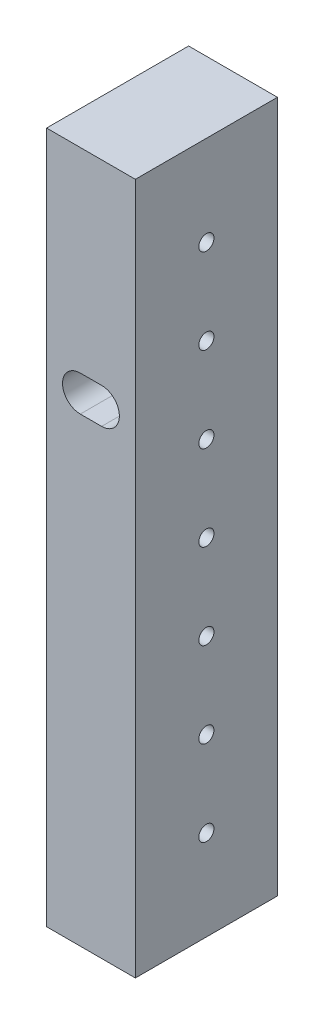
ISO-10303-21;
HEADER;
FILE_DESCRIPTION(('STEP AP214'),'2;1');
FILE_NAME('part.step','',(''),(''),'','','');
FILE_SCHEMA(('AUTOMOTIVE_DESIGN { 1 0 10303 214 1 1 1 1 }'));
ENDSEC;
DATA;
#1=APPLICATION_CONTEXT('core data for automotive mechanical design processes');
#2=APPLICATION_PROTOCOL_DEFINITION('international standard','automotive_design',2000,#1);
#3=PRODUCT_CONTEXT('',#1,'mechanical');
#4=PRODUCT('Part','Part','',(#3));
#5=PRODUCT_RELATED_PRODUCT_CATEGORY('part','',(#4));
#6=PRODUCT_DEFINITION_FORMATION('','',#4);
#7=PRODUCT_DEFINITION_CONTEXT('part definition',#1,'design');
#8=PRODUCT_DEFINITION('design','',#6,#7);
#9=PRODUCT_DEFINITION_SHAPE('','',#8);
#10=(LENGTH_UNIT() NAMED_UNIT(*) SI_UNIT(.MILLI.,.METRE.));
#11=(NAMED_UNIT(*) PLANE_ANGLE_UNIT() SI_UNIT($,.RADIAN.));
#12=(NAMED_UNIT(*) SI_UNIT($,.STERADIAN.) SOLID_ANGLE_UNIT());
#13=UNCERTAINTY_MEASURE_WITH_UNIT(LENGTH_MEASURE(1.E-05),#10,'distance_accuracy_value','');
#14=(GEOMETRIC_REPRESENTATION_CONTEXT(3) GLOBAL_UNCERTAINTY_ASSIGNED_CONTEXT((#13)) GLOBAL_UNIT_ASSIGNED_CONTEXT((#10,
#11,#12)) REPRESENTATION_CONTEXT('',''));
#15=CARTESIAN_POINT('',(0.,0.,0.));
#16=DIRECTION('',(0.,0.,1.));
#17=DIRECTION('',(1.,0.,0.));
#18=AXIS2_PLACEMENT_3D('',#15,#16,#17);
#19=CARTESIAN_POINT('',(0.,123.6726,0.));
#20=DIRECTION('',(1.,0.,0.));
#21=DIRECTION('',(0.,0.,-1.));
#22=AXIS2_PLACEMENT_3D('',#19,#20,#21);
#23=PLANE('',#22);
#24=CARTESIAN_POINT('',(0.,61.8363,-12.7));
#25=DIRECTION('',(-1.,0.,0.));
#26=DIRECTION('',(0.,0.,1.));
#27=AXIS2_PLACEMENT_3D('',#24,#25,#26);
#28=CIRCLE('',#27,1.35254999999999);
#29=CARTESIAN_POINT('',(0.,61.8363,-11.34745));
#30=VERTEX_POINT('',#29);
#31=EDGE_CURVE('E289',#30,#30,#28,.T.);
#32=ORIENTED_EDGE('',*,*,#31,.F.);
#33=EDGE_LOOP('',(#32));
#34=FACE_BOUND('',#33,.T.);
#35=CARTESIAN_POINT('',(0.,77.0763,-12.7));
#36=DIRECTION('',(-1.,0.,0.));
#37=DIRECTION('',(0.,0.,1.));
#38=AXIS2_PLACEMENT_3D('',#35,#36,#37);
#39=CIRCLE('',#38,1.35254999999999);
#40=CARTESIAN_POINT('',(0.,77.0763,-11.34745));
#41=VERTEX_POINT('',#40);
#42=EDGE_CURVE('E295',#41,#41,#39,.T.);
#43=ORIENTED_EDGE('',*,*,#42,.F.);
#44=EDGE_LOOP('',(#43));
#45=FACE_BOUND('',#44,.T.);
#46=CARTESIAN_POINT('',(0.,92.3163,-12.7));
#47=DIRECTION('',(-1.,0.,0.));
#48=DIRECTION('',(0.,0.,1.));
#49=AXIS2_PLACEMENT_3D('',#46,#47,#48);
#50=CIRCLE('',#49,1.35254999999999);
#51=CARTESIAN_POINT('',(0.,92.3163,-11.34745));
#52=VERTEX_POINT('',#51);
#53=EDGE_CURVE('E301',#52,#52,#50,.T.);
#54=ORIENTED_EDGE('',*,*,#53,.F.);
#55=EDGE_LOOP('',(#54));
#56=FACE_BOUND('',#55,.T.);
#57=CARTESIAN_POINT('',(0.,46.5963,-12.7));
#58=DIRECTION('',(-1.,0.,0.));
#59=DIRECTION('',(0.,0.,1.));
#60=AXIS2_PLACEMENT_3D('',#57,#58,#59);
#61=CIRCLE('',#60,1.35254999999999);
#62=CARTESIAN_POINT('',(0.,46.5963,-11.34745));
#63=VERTEX_POINT('',#62);
#64=EDGE_CURVE('E307',#63,#63,#61,.T.);
#65=ORIENTED_EDGE('',*,*,#64,.F.);
#66=EDGE_LOOP('',(#65));
#67=FACE_BOUND('',#66,.T.);
#68=CARTESIAN_POINT('',(0.,31.3563,-12.7));
#69=DIRECTION('',(-1.,0.,0.));
#70=DIRECTION('',(0.,0.,1.));
#71=AXIS2_PLACEMENT_3D('',#68,#69,#70);
#72=CIRCLE('',#71,1.35254999999999);
#73=CARTESIAN_POINT('',(0.,31.3563,-11.34745));
#74=VERTEX_POINT('',#73);
#75=EDGE_CURVE('E313',#74,#74,#72,.T.);
#76=ORIENTED_EDGE('',*,*,#75,.F.);
#77=EDGE_LOOP('',(#76));
#78=FACE_BOUND('',#77,.T.);
#79=CARTESIAN_POINT('',(0.,107.5563,-12.7));
#80=DIRECTION('',(-1.,0.,0.));
#81=DIRECTION('',(0.,0.,1.));
#82=AXIS2_PLACEMENT_3D('',#79,#80,#81);
#83=CIRCLE('',#82,1.35254999999999);
#84=CARTESIAN_POINT('',(0.,107.5563,-11.34745));
#85=VERTEX_POINT('',#84);
#86=EDGE_CURVE('E319',#85,#85,#83,.T.);
#87=ORIENTED_EDGE('',*,*,#86,.F.);
#88=EDGE_LOOP('',(#87));
#89=FACE_BOUND('',#88,.T.);
#90=CARTESIAN_POINT('',(0.,16.1163,-12.7));
#91=DIRECTION('',(-1.,0.,0.));
#92=DIRECTION('',(0.,0.,1.));
#93=AXIS2_PLACEMENT_3D('',#90,#91,#92);
#94=CIRCLE('',#93,1.35254999999999);
#95=CARTESIAN_POINT('',(0.,16.1163,-11.34745));
#96=VERTEX_POINT('',#95);
#97=EDGE_CURVE('E325',#96,#96,#94,.T.);
#98=ORIENTED_EDGE('',*,*,#97,.F.);
#99=EDGE_LOOP('',(#98));
#100=FACE_BOUND('',#99,.T.);
#101=DIRECTION('',(0.,0.,1.));
#102=VECTOR('',#101,1.);
#103=CARTESIAN_POINT('',(0.,0.,0.));
#104=LINE('',#103,#102);
#105=CARTESIAN_POINT('',(0.,0.,-25.4));
#106=VERTEX_POINT('',#105);
#107=CARTESIAN_POINT('',(0.,0.,0.));
#108=VERTEX_POINT('',#107);
#109=EDGE_CURVE('E343',#106,#108,#104,.T.);
#110=ORIENTED_EDGE('',*,*,#109,.T.);
#111=DIRECTION('',(0.,-1.,0.));
#112=VECTOR('',#111,1.);
#113=CARTESIAN_POINT('',(0.,123.6726,0.));
#114=LINE('',#113,#112);
#115=CARTESIAN_POINT('',(0.,123.6726,0.));
#116=VERTEX_POINT('',#115);
#117=EDGE_CURVE('E13',#116,#108,#114,.T.);
#118=ORIENTED_EDGE('',*,*,#117,.F.);
#119=DIRECTION('',(0.,0.,1.));
#120=VECTOR('',#119,1.);
#121=CARTESIAN_POINT('',(0.,123.6726,0.));
#122=LINE('',#121,#120);
#123=CARTESIAN_POINT('',(0.,123.6726,-25.4));
#124=VERTEX_POINT('',#123);
#125=EDGE_CURVE('E344',#124,#116,#122,.T.);
#126=ORIENTED_EDGE('',*,*,#125,.F.);
#127=DIRECTION('',(0.,-1.,0.));
#128=VECTOR('',#127,1.);
#129=CARTESIAN_POINT('',(0.,123.6726,-25.4));
#130=LINE('',#129,#128);
#131=EDGE_CURVE('E354',#124,#106,#130,.T.);
#132=ORIENTED_EDGE('',*,*,#131,.T.);
#133=EDGE_LOOP('',(#110,#118,#126,#132));
#134=FACE_BOUND('',#133,.T.);
#135=ADVANCED_FACE('F185',(#34,#45,#56,#67,#78,#89,#100,#134),#23,.F.);
#136=CARTESIAN_POINT('',(0.,123.6726,0.));
#137=DIRECTION('',(0.,0.,-1.));
#138=DIRECTION('',(-1.,0.,0.));
#139=AXIS2_PLACEMENT_3D('',#136,#137,#138);
#140=PLANE('',#139);
#141=CARTESIAN_POINT('',(6.02949977374883,85.5726000000021,0.));
#142=DIRECTION('',(0.,0.,1.));
#143=DIRECTION('',(1.,0.,0.));
#144=AXIS2_PLACEMENT_3D('',#141,#142,#143);
#145=CIRCLE('',#144,3.17499999999999);
#146=CARTESIAN_POINT('',(6.02949977374883,88.7476000000021,0.));
#147=VERTEX_POINT('',#146);
#148=CARTESIAN_POINT('',(6.02949977374883,82.3976000000022,0.));
#149=VERTEX_POINT('',#148);
#150=EDGE_CURVE('E199',#147,#149,#145,.T.);
#151=ORIENTED_EDGE('',*,*,#150,.F.);
#152=DIRECTION('',(1.,0.,0.));
#153=VECTOR('',#152,1.);
#154=CARTESIAN_POINT('',(6.02949977374883,88.7476000000021,0.));
#155=LINE('',#154,#153);
#156=CARTESIAN_POINT('',(9.83949977374883,88.7476000000021,0.));
#157=VERTEX_POINT('',#156);
#158=EDGE_CURVE('E256',#147,#157,#155,.T.);
#159=ORIENTED_EDGE('',*,*,#158,.T.);
#160=CARTESIAN_POINT('',(9.83949977374883,85.5726000000021,0.));
#161=DIRECTION('',(0.,0.,1.));
#162=DIRECTION('',(1.,0.,0.));
#163=AXIS2_PLACEMENT_3D('',#160,#161,#162);
#164=CIRCLE('',#163,3.17499999999999);
#165=CARTESIAN_POINT('',(9.83949977374883,82.3976000000021,0.));
#166=VERTEX_POINT('',#165);
#167=EDGE_CURVE('E271',#166,#157,#164,.T.);
#168=ORIENTED_EDGE('',*,*,#167,.F.);
#169=DIRECTION('',(1.,0.,0.));
#170=VECTOR('',#169,1.);
#171=CARTESIAN_POINT('',(6.02949977374883,82.3976000000021,0.));
#172=LINE('',#171,#170);
#173=EDGE_CURVE('E277',#149,#166,#172,.T.);
#174=ORIENTED_EDGE('',*,*,#173,.F.);
#175=EDGE_LOOP('',(#151,#159,#168,#174));
#176=FACE_BOUND('',#175,.T.);
#177=DIRECTION('',(1.,0.,0.));
#178=VECTOR('',#177,1.);
#179=CARTESIAN_POINT('',(0.,0.,0.));
#180=LINE('',#179,#178);
#181=CARTESIAN_POINT('',(15.875,0.,0.));
#182=VERTEX_POINT('',#181);
#183=EDGE_CURVE('E357',#108,#182,#180,.T.);
#184=ORIENTED_EDGE('',*,*,#183,.T.);
#185=DIRECTION('',(0.,-1.,0.));
#186=VECTOR('',#185,1.);
#187=CARTESIAN_POINT('',(15.875,123.6726,0.));
#188=LINE('',#187,#186);
#189=CARTESIAN_POINT('',(15.875,123.6726,0.));
#190=VERTEX_POINT('',#189);
#191=EDGE_CURVE('E192',#190,#182,#188,.T.);
#192=ORIENTED_EDGE('',*,*,#191,.F.);
#193=DIRECTION('',(1.,0.,0.));
#194=VECTOR('',#193,1.);
#195=CARTESIAN_POINT('',(0.,123.6726,0.));
#196=LINE('',#195,#194);
#197=EDGE_CURVE('E347',#116,#190,#196,.T.);
#198=ORIENTED_EDGE('',*,*,#197,.F.);
#199=ORIENTED_EDGE('',*,*,#117,.T.);
#200=EDGE_LOOP('',(#184,#192,#198,#199));
#201=FACE_BOUND('',#200,.T.);
#202=ADVANCED_FACE('F275',(#176,#201),#140,.F.);
#203=CARTESIAN_POINT('',(15.875,123.6726,0.));
#204=DIRECTION('',(-1.,0.,0.));
#205=DIRECTION('',(0.,0.,1.));
#206=AXIS2_PLACEMENT_3D('',#203,#204,#205);
#207=PLANE('',#206);
#208=CARTESIAN_POINT('',(15.875,61.8363,-12.7));
#209=DIRECTION('',(-1.,0.,0.));
#210=DIRECTION('',(0.,0.,1.));
#211=AXIS2_PLACEMENT_3D('',#208,#209,#210);
#212=CIRCLE('',#211,1.35254999999999);
#213=CARTESIAN_POINT('',(15.875,61.8363,-11.34745));
#214=VERTEX_POINT('',#213);
#215=EDGE_CURVE('E292',#214,#214,#212,.T.);
#216=ORIENTED_EDGE('',*,*,#215,.T.);
#217=EDGE_LOOP('',(#216));
#218=FACE_BOUND('',#217,.T.);
#219=CARTESIAN_POINT('',(15.875,77.0763,-12.7));
#220=DIRECTION('',(-1.,0.,0.));
#221=DIRECTION('',(0.,0.,1.));
#222=AXIS2_PLACEMENT_3D('',#219,#220,#221);
#223=CIRCLE('',#222,1.35254999999999);
#224=CARTESIAN_POINT('',(15.875,77.0763,-11.34745));
#225=VERTEX_POINT('',#224);
#226=EDGE_CURVE('E298',#225,#225,#223,.T.);
#227=ORIENTED_EDGE('',*,*,#226,.T.);
#228=EDGE_LOOP('',(#227));
#229=FACE_BOUND('',#228,.T.);
#230=CARTESIAN_POINT('',(15.875,92.3163,-12.7));
#231=DIRECTION('',(-1.,0.,0.));
#232=DIRECTION('',(0.,0.,1.));
#233=AXIS2_PLACEMENT_3D('',#230,#231,#232);
#234=CIRCLE('',#233,1.35254999999999);
#235=CARTESIAN_POINT('',(15.875,92.3163,-11.34745));
#236=VERTEX_POINT('',#235);
#237=EDGE_CURVE('E304',#236,#236,#234,.T.);
#238=ORIENTED_EDGE('',*,*,#237,.T.);
#239=EDGE_LOOP('',(#238));
#240=FACE_BOUND('',#239,.T.);
#241=CARTESIAN_POINT('',(15.875,46.5963,-12.7));
#242=DIRECTION('',(-1.,0.,0.));
#243=DIRECTION('',(0.,0.,1.));
#244=AXIS2_PLACEMENT_3D('',#241,#242,#243);
#245=CIRCLE('',#244,1.35254999999999);
#246=CARTESIAN_POINT('',(15.875,46.5963,-11.34745));
#247=VERTEX_POINT('',#246);
#248=EDGE_CURVE('E310',#247,#247,#245,.T.);
#249=ORIENTED_EDGE('',*,*,#248,.T.);
#250=EDGE_LOOP('',(#249));
#251=FACE_BOUND('',#250,.T.);
#252=CARTESIAN_POINT('',(15.875,31.3563,-12.7));
#253=DIRECTION('',(-1.,0.,0.));
#254=DIRECTION('',(0.,0.,1.));
#255=AXIS2_PLACEMENT_3D('',#252,#253,#254);
#256=CIRCLE('',#255,1.35254999999999);
#257=CARTESIAN_POINT('',(15.875,31.3563,-11.34745));
#258=VERTEX_POINT('',#257);
#259=EDGE_CURVE('E316',#258,#258,#256,.T.);
#260=ORIENTED_EDGE('',*,*,#259,.T.);
#261=EDGE_LOOP('',(#260));
#262=FACE_BOUND('',#261,.T.);
#263=CARTESIAN_POINT('',(15.875,107.5563,-12.7));
#264=DIRECTION('',(-1.,0.,0.));
#265=DIRECTION('',(0.,0.,1.));
#266=AXIS2_PLACEMENT_3D('',#263,#264,#265);
#267=CIRCLE('',#266,1.35254999999999);
#268=CARTESIAN_POINT('',(15.875,107.5563,-11.34745));
#269=VERTEX_POINT('',#268);
#270=EDGE_CURVE('E322',#269,#269,#267,.T.);
#271=ORIENTED_EDGE('',*,*,#270,.T.);
#272=EDGE_LOOP('',(#271));
#273=FACE_BOUND('',#272,.T.);
#274=CARTESIAN_POINT('',(15.875,16.1163,-12.7));
#275=DIRECTION('',(-1.,0.,0.));
#276=DIRECTION('',(0.,0.,1.));
#277=AXIS2_PLACEMENT_3D('',#274,#275,#276);
#278=CIRCLE('',#277,1.35254999999999);
#279=CARTESIAN_POINT('',(15.875,16.1163,-11.34745));
#280=VERTEX_POINT('',#279);
#281=EDGE_CURVE('E328',#280,#280,#278,.T.);
#282=ORIENTED_EDGE('',*,*,#281,.T.);
#283=EDGE_LOOP('',(#282));
#284=FACE_BOUND('',#283,.T.);
#285=DIRECTION('',(0.,0.,-1.));
#286=VECTOR('',#285,1.);
#287=CARTESIAN_POINT('',(15.875,0.,0.));
#288=LINE('',#287,#286);
#289=CARTESIAN_POINT('',(15.875,0.,-25.4));
#290=VERTEX_POINT('',#289);
#291=EDGE_CURVE('E359',#182,#290,#288,.T.);
#292=ORIENTED_EDGE('',*,*,#291,.T.);
#293=DIRECTION('',(0.,-1.,0.));
#294=VECTOR('',#293,1.);
#295=CARTESIAN_POINT('',(15.875,123.6726,-25.4));
#296=LINE('',#295,#294);
#297=CARTESIAN_POINT('',(15.875,123.6726,-25.4));
#298=VERTEX_POINT('',#297);
#299=EDGE_CURVE('E364',#298,#290,#296,.T.);
#300=ORIENTED_EDGE('',*,*,#299,.F.);
#301=DIRECTION('',(0.,0.,-1.));
#302=VECTOR('',#301,1.);
#303=CARTESIAN_POINT('',(15.875,123.6726,0.));
#304=LINE('',#303,#302);
#305=EDGE_CURVE('E350',#190,#298,#304,.T.);
#306=ORIENTED_EDGE('',*,*,#305,.F.);
#307=ORIENTED_EDGE('',*,*,#191,.T.);
#308=EDGE_LOOP('',(#292,#300,#306,#307));
#309=FACE_BOUND('',#308,.T.);
#310=ADVANCED_FACE('F371',(#218,#229,#240,#251,#262,#273,#284,#309),#207,.F.);
#311=CARTESIAN_POINT('',(0.,123.6726,-25.4));
#312=DIRECTION('',(0.,0.,1.));
#313=DIRECTION('',(1.,0.,0.));
#314=AXIS2_PLACEMENT_3D('',#311,#312,#313);
#315=PLANE('',#314);
#316=DIRECTION('',(1.,0.,0.));
#317=VECTOR('',#316,1.);
#318=CARTESIAN_POINT('',(6.02949977374883,88.7476000000021,-25.4));
#319=LINE('',#318,#317);
#320=CARTESIAN_POINT('',(6.02949977374883,88.7476000000021,-25.4));
#321=VERTEX_POINT('',#320);
#322=CARTESIAN_POINT('',(9.83949977374883,88.7476000000021,-25.4));
#323=VERTEX_POINT('',#322);
#324=EDGE_CURVE('E265',#321,#323,#319,.T.);
#325=ORIENTED_EDGE('',*,*,#324,.F.);
#326=CARTESIAN_POINT('',(6.02949977374883,85.5726000000021,-25.4));
#327=DIRECTION('',(0.,0.,1.));
#328=DIRECTION('',(1.,0.,0.));
#329=AXIS2_PLACEMENT_3D('',#326,#327,#328);
#330=CIRCLE('',#329,3.17499999999993);
#331=CARTESIAN_POINT('',(6.02949977374883,82.3976000000022,-25.4));
#332=VERTEX_POINT('',#331);
#333=EDGE_CURVE('E269',#321,#332,#330,.T.);
#334=ORIENTED_EDGE('',*,*,#333,.T.);
#335=DIRECTION('',(1.,0.,0.));
#336=VECTOR('',#335,1.);
#337=CARTESIAN_POINT('',(6.02949977374883,82.3976000000022,-25.4));
#338=LINE('',#337,#336);
#339=CARTESIAN_POINT('',(9.83949977374883,82.3976000000022,-25.4));
#340=VERTEX_POINT('',#339);
#341=EDGE_CURVE('E582',#332,#340,#338,.T.);
#342=ORIENTED_EDGE('',*,*,#341,.T.);
#343=CARTESIAN_POINT('',(9.83949977374883,85.5726000000021,-25.4));
#344=DIRECTION('',(0.,0.,1.));
#345=DIRECTION('',(1.,0.,0.));
#346=AXIS2_PLACEMENT_3D('',#343,#344,#345);
#347=CIRCLE('',#346,3.17499999999993);
#348=EDGE_CURVE('E284',#340,#323,#347,.T.);
#349=ORIENTED_EDGE('',*,*,#348,.T.);
#350=EDGE_LOOP('',(#325,#334,#342,#349));
#351=FACE_BOUND('',#350,.T.);
#352=DIRECTION('',(-1.,0.,0.));
#353=VECTOR('',#352,1.);
#354=CARTESIAN_POINT('',(0.,0.,-25.4));
#355=LINE('',#354,#353);
#356=EDGE_CURVE('E348',#290,#106,#355,.T.);
#357=ORIENTED_EDGE('',*,*,#356,.T.);
#358=ORIENTED_EDGE('',*,*,#131,.F.);
#359=DIRECTION('',(-1.,0.,0.));
#360=VECTOR('',#359,1.);
#361=CARTESIAN_POINT('',(0.,123.6726,-25.4));
#362=LINE('',#361,#360);
#363=EDGE_CURVE('E352',#298,#124,#362,.T.);
#364=ORIENTED_EDGE('',*,*,#363,.F.);
#365=ORIENTED_EDGE('',*,*,#299,.T.);
#366=EDGE_LOOP('',(#357,#358,#364,#365));
#367=FACE_BOUND('',#366,.T.);
#368=ADVANCED_FACE('F379',(#351,#367),#315,.F.);
#369=CARTESIAN_POINT('',(0.,123.6726,0.));
#370=DIRECTION('',(0.,-1.,0.));
#371=DIRECTION('',(0.,0.,-1.));
#372=AXIS2_PLACEMENT_3D('',#369,#370,#371);
#373=PLANE('',#372);
#374=ORIENTED_EDGE('',*,*,#125,.T.);
#375=ORIENTED_EDGE('',*,*,#197,.T.);
#376=ORIENTED_EDGE('',*,*,#305,.T.);
#377=ORIENTED_EDGE('',*,*,#363,.T.);
#378=EDGE_LOOP('',(#374,#375,#376,#377));
#379=FACE_BOUND('',#378,.T.);
#380=ADVANCED_FACE('F385',(#379),#373,.F.);
#381=CARTESIAN_POINT('',(0.,0.,0.));
#382=DIRECTION('',(0.,-1.,0.));
#383=DIRECTION('',(0.,0.,-1.));
#384=AXIS2_PLACEMENT_3D('',#381,#382,#383);
#385=PLANE('',#384);
#386=CARTESIAN_POINT('',(7.9375,0.,-6.));
#387=DIRECTION('',(0.,-1.,0.));
#388=DIRECTION('',(0.,0.,-1.));
#389=AXIS2_PLACEMENT_3D('',#386,#387,#388);
#390=CIRCLE('',#389,1.89865);
#391=CARTESIAN_POINT('',(7.9375,0.,-7.89865));
#392=VERTEX_POINT('',#391);
#393=EDGE_CURVE('E331',#392,#392,#390,.T.);
#394=ORIENTED_EDGE('',*,*,#393,.F.);
#395=EDGE_LOOP('',(#394));
#396=FACE_BOUND('',#395,.T.);
#397=CARTESIAN_POINT('',(7.9375,0.,-19.4));
#398=DIRECTION('',(0.,-1.,0.));
#399=DIRECTION('',(0.,0.,-1.));
#400=AXIS2_PLACEMENT_3D('',#397,#398,#399);
#401=CIRCLE('',#400,1.89865);
#402=CARTESIAN_POINT('',(7.9375,0.,-21.29865));
#403=VERTEX_POINT('',#402);
#404=EDGE_CURVE('E337',#403,#403,#401,.T.);
#405=ORIENTED_EDGE('',*,*,#404,.F.);
#406=EDGE_LOOP('',(#405));
#407=FACE_BOUND('',#406,.T.);
#408=ORIENTED_EDGE('',*,*,#109,.F.);
#409=ORIENTED_EDGE('',*,*,#356,.F.);
#410=ORIENTED_EDGE('',*,*,#291,.F.);
#411=ORIENTED_EDGE('',*,*,#183,.F.);
#412=EDGE_LOOP('',(#408,#409,#410,#411));
#413=FACE_BOUND('',#412,.T.);
#414=ADVANCED_FACE('F376',(#396,#407,#413),#385,.T.);
#415=CARTESIAN_POINT('',(7.9375,20.701,-19.4));
#416=DIRECTION('',(0.,-1.,0.));
#417=DIRECTION('',(0.,0.,-1.));
#418=AXIS2_PLACEMENT_3D('',#415,#416,#417);
#419=CONICAL_SURFACE('',#418,1.89864999999999,1.02974425867665);
#420=CARTESIAN_POINT('',(7.93749999999999,21.8418240143167,-19.4));
#421=VERTEX_POINT('',#420);
#422=VERTEX_LOOP('',#421);
#423=FACE_BOUND('',#422,.T.);
#424=CARTESIAN_POINT('',(7.9375,20.701,-19.4));
#425=DIRECTION('',(0.,-1.,0.));
#426=DIRECTION('',(0.,0.,-1.));
#427=AXIS2_PLACEMENT_3D('',#424,#425,#426);
#428=CIRCLE('',#427,1.89864999999999);
#429=CARTESIAN_POINT('',(7.9375,20.701,-21.29865));
#430=VERTEX_POINT('',#429);
#431=EDGE_CURVE('E340',#430,#430,#428,.T.);
#432=ORIENTED_EDGE('',*,*,#431,.T.);
#433=EDGE_LOOP('',(#432));
#434=FACE_BOUND('',#433,.T.);
#435=ADVANCED_FACE('F400',(#423,#434),#419,.F.);
#436=CARTESIAN_POINT('',(7.9375,0.,-19.4));
#437=DIRECTION('',(0.,-1.,0.));
#438=DIRECTION('',(0.,0.,-1.));
#439=AXIS2_PLACEMENT_3D('',#436,#437,#438);
#440=CYLINDRICAL_SURFACE('',#439,1.89865);
#441=ORIENTED_EDGE('',*,*,#431,.F.);
#442=EDGE_LOOP('',(#441));
#443=FACE_BOUND('',#442,.T.);
#444=ORIENTED_EDGE('',*,*,#404,.T.);
#445=EDGE_LOOP('',(#444));
#446=FACE_BOUND('',#445,.T.);
#447=ADVANCED_FACE('F406',(#443,#446),#440,.F.);
#448=CARTESIAN_POINT('',(7.9375,20.701,-6.));
#449=DIRECTION('',(0.,-1.,0.));
#450=DIRECTION('',(0.,0.,-1.));
#451=AXIS2_PLACEMENT_3D('',#448,#449,#450);
#452=CONICAL_SURFACE('',#451,1.89864999999999,1.02974425867665);
#453=CARTESIAN_POINT('',(7.93749999999999,21.8418240143167,-6.));
#454=VERTEX_POINT('',#453);
#455=VERTEX_LOOP('',#454);
#456=FACE_BOUND('',#455,.T.);
#457=CARTESIAN_POINT('',(7.9375,20.701,-6.));
#458=DIRECTION('',(0.,-1.,0.));
#459=DIRECTION('',(0.,0.,-1.));
#460=AXIS2_PLACEMENT_3D('',#457,#458,#459);
#461=CIRCLE('',#460,1.89864999999999);
#462=CARTESIAN_POINT('',(7.9375,20.701,-7.89864999999999));
#463=VERTEX_POINT('',#462);
#464=EDGE_CURVE('E334',#463,#463,#461,.T.);
#465=ORIENTED_EDGE('',*,*,#464,.T.);
#466=EDGE_LOOP('',(#465));
#467=FACE_BOUND('',#466,.T.);
#468=ADVANCED_FACE('F410',(#456,#467),#452,.F.);
#469=CARTESIAN_POINT('',(7.9375,0.,-6.));
#470=DIRECTION('',(0.,-1.,0.));
#471=DIRECTION('',(0.,0.,-1.));
#472=AXIS2_PLACEMENT_3D('',#469,#470,#471);
#473=CYLINDRICAL_SURFACE('',#472,1.89865);
#474=ORIENTED_EDGE('',*,*,#464,.F.);
#475=EDGE_LOOP('',(#474));
#476=FACE_BOUND('',#475,.T.);
#477=ORIENTED_EDGE('',*,*,#393,.T.);
#478=EDGE_LOOP('',(#477));
#479=FACE_BOUND('',#478,.T.);
#480=ADVANCED_FACE('F414',(#476,#479),#473,.F.);
#481=CARTESIAN_POINT('',(0.,16.1163,-12.7));
#482=DIRECTION('',(-1.,0.,0.));
#483=DIRECTION('',(0.,0.,1.));
#484=AXIS2_PLACEMENT_3D('',#481,#482,#483);
#485=CYLINDRICAL_SURFACE('',#484,1.35254999999999);
#486=ORIENTED_EDGE('',*,*,#281,.F.);
#487=EDGE_LOOP('',(#486));
#488=FACE_BOUND('',#487,.T.);
#489=ORIENTED_EDGE('',*,*,#97,.T.);
#490=EDGE_LOOP('',(#489));
#491=FACE_BOUND('',#490,.T.);
#492=ADVANCED_FACE('F418',(#488,#491),#485,.F.);
#493=CARTESIAN_POINT('',(0.,107.5563,-12.7));
#494=DIRECTION('',(-1.,0.,0.));
#495=DIRECTION('',(0.,0.,1.));
#496=AXIS2_PLACEMENT_3D('',#493,#494,#495);
#497=CYLINDRICAL_SURFACE('',#496,1.35254999999999);
#498=ORIENTED_EDGE('',*,*,#270,.F.);
#499=EDGE_LOOP('',(#498));
#500=FACE_BOUND('',#499,.T.);
#501=ORIENTED_EDGE('',*,*,#86,.T.);
#502=EDGE_LOOP('',(#501));
#503=FACE_BOUND('',#502,.T.);
#504=ADVANCED_FACE('F422',(#500,#503),#497,.F.);
#505=CARTESIAN_POINT('',(0.,31.3563,-12.7));
#506=DIRECTION('',(-1.,0.,0.));
#507=DIRECTION('',(0.,0.,1.));
#508=AXIS2_PLACEMENT_3D('',#505,#506,#507);
#509=CYLINDRICAL_SURFACE('',#508,1.35254999999999);
#510=ORIENTED_EDGE('',*,*,#259,.F.);
#511=EDGE_LOOP('',(#510));
#512=FACE_BOUND('',#511,.T.);
#513=ORIENTED_EDGE('',*,*,#75,.T.);
#514=EDGE_LOOP('',(#513));
#515=FACE_BOUND('',#514,.T.);
#516=ADVANCED_FACE('F426',(#512,#515),#509,.F.);
#517=CARTESIAN_POINT('',(0.,46.5963,-12.7));
#518=DIRECTION('',(-1.,0.,0.));
#519=DIRECTION('',(0.,0.,1.));
#520=AXIS2_PLACEMENT_3D('',#517,#518,#519);
#521=CYLINDRICAL_SURFACE('',#520,1.35254999999999);
#522=ORIENTED_EDGE('',*,*,#248,.F.);
#523=EDGE_LOOP('',(#522));
#524=FACE_BOUND('',#523,.T.);
#525=ORIENTED_EDGE('',*,*,#64,.T.);
#526=EDGE_LOOP('',(#525));
#527=FACE_BOUND('',#526,.T.);
#528=ADVANCED_FACE('F430',(#524,#527),#521,.F.);
#529=CARTESIAN_POINT('',(0.,92.3163,-12.7));
#530=DIRECTION('',(-1.,0.,0.));
#531=DIRECTION('',(0.,0.,1.));
#532=AXIS2_PLACEMENT_3D('',#529,#530,#531);
#533=CYLINDRICAL_SURFACE('',#532,1.35254999999999);
#534=ORIENTED_EDGE('',*,*,#237,.F.);
#535=EDGE_LOOP('',(#534));
#536=FACE_BOUND('',#535,.T.);
#537=ORIENTED_EDGE('',*,*,#53,.T.);
#538=EDGE_LOOP('',(#537));
#539=FACE_BOUND('',#538,.T.);
#540=ADVANCED_FACE('F434',(#536,#539),#533,.F.);
#541=CARTESIAN_POINT('',(0.,77.0763,-12.7));
#542=DIRECTION('',(-1.,0.,0.));
#543=DIRECTION('',(0.,0.,1.));
#544=AXIS2_PLACEMENT_3D('',#541,#542,#543);
#545=CYLINDRICAL_SURFACE('',#544,1.35254999999999);
#546=ORIENTED_EDGE('',*,*,#226,.F.);
#547=EDGE_LOOP('',(#546));
#548=FACE_BOUND('',#547,.T.);
#549=ORIENTED_EDGE('',*,*,#42,.T.);
#550=EDGE_LOOP('',(#549));
#551=FACE_BOUND('',#550,.T.);
#552=ADVANCED_FACE('F438',(#548,#551),#545,.F.);
#553=CARTESIAN_POINT('',(0.,61.8363,-12.7));
#554=DIRECTION('',(-1.,0.,0.));
#555=DIRECTION('',(0.,0.,1.));
#556=AXIS2_PLACEMENT_3D('',#553,#554,#555);
#557=CYLINDRICAL_SURFACE('',#556,1.35254999999999);
#558=ORIENTED_EDGE('',*,*,#215,.F.);
#559=EDGE_LOOP('',(#558));
#560=FACE_BOUND('',#559,.T.);
#561=ORIENTED_EDGE('',*,*,#31,.T.);
#562=EDGE_LOOP('',(#561));
#563=FACE_BOUND('',#562,.T.);
#564=ADVANCED_FACE('F442',(#560,#563),#557,.F.);
#565=CARTESIAN_POINT('',(9.83949977374883,85.5726000000021,0.));
#566=DIRECTION('',(0.,0.,1.));
#567=DIRECTION('',(1.,0.,0.));
#568=AXIS2_PLACEMENT_3D('',#565,#566,#567);
#569=CYLINDRICAL_SURFACE('',#568,3.17499999999996);
#570=ORIENTED_EDGE('',*,*,#348,.F.);
#571=DIRECTION('',(0.,0.,1.));
#572=VECTOR('',#571,1.);
#573=CARTESIAN_POINT('',(9.83949977374883,82.3976000000022,0.));
#574=LINE('',#573,#572);
#575=EDGE_CURVE('E207',#166,#340,#574,.F.);
#576=ORIENTED_EDGE('',*,*,#575,.F.);
#577=ORIENTED_EDGE('',*,*,#167,.T.);
#578=DIRECTION('',(0.,0.,1.));
#579=VECTOR('',#578,1.);
#580=CARTESIAN_POINT('',(9.83949977374883,88.7476000000021,0.));
#581=LINE('',#580,#579);
#582=EDGE_CURVE('E261',#323,#157,#581,.T.);
#583=ORIENTED_EDGE('',*,*,#582,.F.);
#584=EDGE_LOOP('',(#570,#576,#577,#583));
#585=FACE_BOUND('',#584,.T.);
#586=ADVANCED_FACE('F446',(#585),#569,.F.);
#587=CARTESIAN_POINT('',(6.02949977374883,85.5726000000021,0.));
#588=DIRECTION('',(0.,0.,1.));
#589=DIRECTION('',(1.,0.,0.));
#590=AXIS2_PLACEMENT_3D('',#587,#588,#589);
#591=CYLINDRICAL_SURFACE('',#590,3.17499999999996);
#592=ORIENTED_EDGE('',*,*,#150,.T.);
#593=DIRECTION('',(0.,0.,1.));
#594=VECTOR('',#593,1.);
#595=CARTESIAN_POINT('',(6.02949977374883,82.3976000000022,0.));
#596=LINE('',#595,#594);
#597=EDGE_CURVE('E272',#332,#149,#596,.T.);
#598=ORIENTED_EDGE('',*,*,#597,.F.);
#599=ORIENTED_EDGE('',*,*,#333,.F.);
#600=DIRECTION('',(0.,0.,1.));
#601=VECTOR('',#600,1.);
#602=CARTESIAN_POINT('',(6.02949977374883,88.7476000000021,0.));
#603=LINE('',#602,#601);
#604=EDGE_CURVE('E258',#147,#321,#603,.F.);
#605=ORIENTED_EDGE('',*,*,#604,.F.);
#606=EDGE_LOOP('',(#592,#598,#599,#605));
#607=FACE_BOUND('',#606,.T.);
#608=ADVANCED_FACE('F267',(#607),#591,.F.);
#609=CARTESIAN_POINT('',(6.02949977374883,88.7476000000021,0.));
#610=DIRECTION('',(0.,1.,0.));
#611=DIRECTION('',(0.,0.,1.));
#612=AXIS2_PLACEMENT_3D('',#609,#610,#611);
#613=PLANE('',#612);
#614=ORIENTED_EDGE('',*,*,#582,.T.);
#615=ORIENTED_EDGE('',*,*,#158,.F.);
#616=ORIENTED_EDGE('',*,*,#604,.T.);
#617=ORIENTED_EDGE('',*,*,#324,.T.);
#618=EDGE_LOOP('',(#614,#615,#616,#617));
#619=FACE_BOUND('',#618,.T.);
#620=ADVANCED_FACE('F257',(#619),#613,.F.);
#621=CARTESIAN_POINT('',(6.02949977374883,82.3976000000022,0.));
#622=DIRECTION('',(0.,-1.,0.));
#623=DIRECTION('',(0.,0.,-1.));
#624=AXIS2_PLACEMENT_3D('',#621,#622,#623);
#625=PLANE('',#624);
#626=ORIENTED_EDGE('',*,*,#575,.T.);
#627=ORIENTED_EDGE('',*,*,#341,.F.);
#628=ORIENTED_EDGE('',*,*,#597,.T.);
#629=ORIENTED_EDGE('',*,*,#173,.T.);
#630=EDGE_LOOP('',(#626,#627,#628,#629));
#631=FACE_BOUND('',#630,.T.);
#632=ADVANCED_FACE('F455',(#631),#625,.F.);
#633=CLOSED_SHELL('',(#135,#202,#310,#368,#380,#414,#435,#447,#468,#480,#492,#504,#516,#528,
#540,#552,#564,#586,#608,#620,#632));
#634=MANIFOLD_SOLID_BREP('B2',#633);
#635=ADVANCED_BREP_SHAPE_REPRESENTATION('',(#18,#634),#14);
#636=SHAPE_DEFINITION_REPRESENTATION(#9,#635);
ENDSEC;
END-ISO-10303-21;
